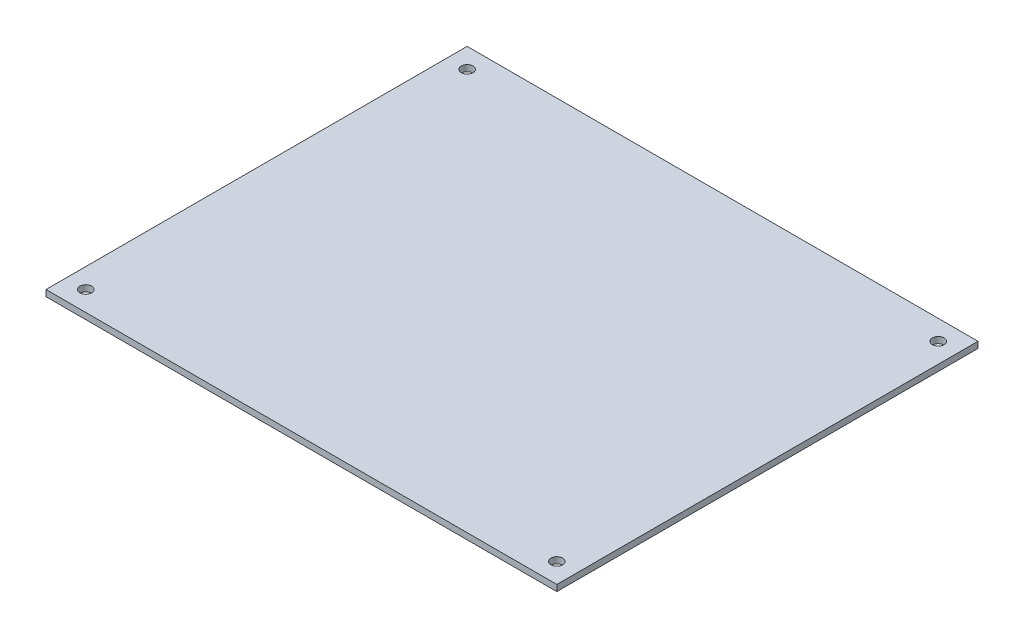
ISO-10303-21;
HEADER;
FILE_DESCRIPTION(('STEP AP214'),'2;1');
FILE_NAME('part.step','',(''),(''),'','','');
FILE_SCHEMA(('AUTOMOTIVE_DESIGN { 1 0 10303 214 1 1 1 1 }'));
ENDSEC;
DATA;
#1=APPLICATION_CONTEXT('core data for automotive mechanical design processes');
#2=APPLICATION_PROTOCOL_DEFINITION('international standard','automotive_design',2000,#1);
#3=PRODUCT_CONTEXT('',#1,'mechanical');
#4=PRODUCT('Part','Part','',(#3));
#5=PRODUCT_RELATED_PRODUCT_CATEGORY('part','',(#4));
#6=PRODUCT_DEFINITION_FORMATION('','',#4);
#7=PRODUCT_DEFINITION_CONTEXT('part definition',#1,'design');
#8=PRODUCT_DEFINITION('design','',#6,#7);
#9=PRODUCT_DEFINITION_SHAPE('','',#8);
#10=(LENGTH_UNIT() NAMED_UNIT(*) SI_UNIT(.MILLI.,.METRE.));
#11=(NAMED_UNIT(*) PLANE_ANGLE_UNIT() SI_UNIT($,.RADIAN.));
#12=(NAMED_UNIT(*) SI_UNIT($,.STERADIAN.) SOLID_ANGLE_UNIT());
#13=UNCERTAINTY_MEASURE_WITH_UNIT(LENGTH_MEASURE(1.E-05),#10,'distance_accuracy_value','');
#14=(GEOMETRIC_REPRESENTATION_CONTEXT(3) GLOBAL_UNCERTAINTY_ASSIGNED_CONTEXT((#13)) GLOBAL_UNIT_ASSIGNED_CONTEXT((#10,
#11,#12)) REPRESENTATION_CONTEXT('',''));
#15=CARTESIAN_POINT('',(0.,0.,0.));
#16=DIRECTION('',(0.,0.,1.));
#17=DIRECTION('',(1.,0.,0.));
#18=AXIS2_PLACEMENT_3D('',#15,#16,#17);
#19=CARTESIAN_POINT('',(65.5,1.6,54.));
#20=DIRECTION('',(0.,1.,0.));
#21=DIRECTION('',(0.,0.,1.));
#22=AXIS2_PLACEMENT_3D('',#19,#20,#21);
#23=PLANE('',#22);
#24=CARTESIAN_POINT('',(60.4,1.6,48.9));
#25=DIRECTION('',(0.,1.,0.));
#26=DIRECTION('',(0.,0.,1.));
#27=AXIS2_PLACEMENT_3D('',#24,#25,#26);
#28=CIRCLE('',#27,1.5);
#29=CARTESIAN_POINT('',(60.4,1.6,50.4));
#30=VERTEX_POINT('',#29);
#31=EDGE_CURVE('E119',#30,#30,#28,.T.);
#32=ORIENTED_EDGE('',*,*,#31,.F.);
#33=EDGE_LOOP('',(#32));
#34=FACE_BOUND('',#33,.T.);
#35=CARTESIAN_POINT('',(-60.4,1.6,-48.9));
#36=DIRECTION('',(0.,1.,0.));
#37=DIRECTION('',(0.,0.,1.));
#38=AXIS2_PLACEMENT_3D('',#35,#36,#37);
#39=CIRCLE('',#38,1.5);
#40=CARTESIAN_POINT('',(-60.4,1.6,-47.4));
#41=VERTEX_POINT('',#40);
#42=EDGE_CURVE('E98',#41,#41,#39,.T.);
#43=ORIENTED_EDGE('',*,*,#42,.F.);
#44=EDGE_LOOP('',(#43));
#45=FACE_BOUND('',#44,.T.);
#46=DIRECTION('',(0.,0.,-1.));
#47=VECTOR('',#46,1.);
#48=CARTESIAN_POINT('',(65.5,1.6,-54.));
#49=LINE('',#48,#47);
#50=CARTESIAN_POINT('',(65.5,1.6,54.));
#51=VERTEX_POINT('',#50);
#52=CARTESIAN_POINT('',(65.5,1.6,-54.));
#53=VERTEX_POINT('',#52);
#54=EDGE_CURVE('E83',#51,#53,#49,.T.);
#55=ORIENTED_EDGE('',*,*,#54,.T.);
#56=DIRECTION('',(-1.,0.,0.));
#57=VECTOR('',#56,1.);
#58=CARTESIAN_POINT('',(-65.5,1.6,-54.));
#59=LINE('',#58,#57);
#60=CARTESIAN_POINT('',(-65.5,1.6,-54.));
#61=VERTEX_POINT('',#60);
#62=EDGE_CURVE('E78',#53,#61,#59,.T.);
#63=ORIENTED_EDGE('',*,*,#62,.T.);
#64=DIRECTION('',(0.,0.,1.));
#65=VECTOR('',#64,1.);
#66=CARTESIAN_POINT('',(-65.5,1.6,-54.));
#67=LINE('',#66,#65);
#68=CARTESIAN_POINT('',(-65.5,1.6,54.));
#69=VERTEX_POINT('',#68);
#70=EDGE_CURVE('E81',#61,#69,#67,.T.);
#71=ORIENTED_EDGE('',*,*,#70,.T.);
#72=DIRECTION('',(1.,0.,0.));
#73=VECTOR('',#72,1.);
#74=CARTESIAN_POINT('',(-65.5,1.6,54.));
#75=LINE('',#74,#73);
#76=EDGE_CURVE('E48',#69,#51,#75,.T.);
#77=ORIENTED_EDGE('',*,*,#76,.T.);
#78=EDGE_LOOP('',(#55,#63,#71,#77));
#79=FACE_BOUND('',#78,.T.);
#80=CARTESIAN_POINT('',(-60.4,1.6,48.9));
#81=DIRECTION('',(0.,1.,0.));
#82=DIRECTION('',(0.,0.,1.));
#83=AXIS2_PLACEMENT_3D('',#80,#81,#82);
#84=CIRCLE('',#83,1.5);
#85=CARTESIAN_POINT('',(-60.4,1.6,50.4));
#86=VERTEX_POINT('',#85);
#87=EDGE_CURVE('E113',#86,#86,#84,.T.);
#88=ORIENTED_EDGE('',*,*,#87,.F.);
#89=EDGE_LOOP('',(#88));
#90=FACE_BOUND('',#89,.T.);
#91=CARTESIAN_POINT('',(60.4,1.6,-48.9));
#92=DIRECTION('',(0.,1.,0.));
#93=DIRECTION('',(0.,0.,1.));
#94=AXIS2_PLACEMENT_3D('',#91,#92,#93);
#95=CIRCLE('',#94,1.5);
#96=CARTESIAN_POINT('',(60.4,1.6,-47.4));
#97=VERTEX_POINT('',#96);
#98=EDGE_CURVE('E125',#97,#97,#95,.T.);
#99=ORIENTED_EDGE('',*,*,#98,.F.);
#100=EDGE_LOOP('',(#99));
#101=FACE_BOUND('',#100,.T.);
#102=ADVANCED_FACE('F31',(#34,#45,#79,#90,#101),#23,.T.);
#103=CARTESIAN_POINT('',(65.5,0.,54.));
#104=DIRECTION('',(0.,1.,0.));
#105=DIRECTION('',(0.,0.,1.));
#106=AXIS2_PLACEMENT_3D('',#103,#104,#105);
#107=PLANE('',#106);
#108=CARTESIAN_POINT('',(60.4,0.,48.9));
#109=DIRECTION('',(0.,1.,0.));
#110=DIRECTION('',(0.,0.,1.));
#111=AXIS2_PLACEMENT_3D('',#108,#109,#110);
#112=CIRCLE('',#111,1.5);
#113=CARTESIAN_POINT('',(60.4,0.,50.4));
#114=VERTEX_POINT('',#113);
#115=EDGE_CURVE('E122',#114,#114,#112,.T.);
#116=ORIENTED_EDGE('',*,*,#115,.T.);
#117=EDGE_LOOP('',(#116));
#118=FACE_BOUND('',#117,.T.);
#119=CARTESIAN_POINT('',(-60.4,0.,-48.9));
#120=DIRECTION('',(0.,1.,0.));
#121=DIRECTION('',(0.,0.,1.));
#122=AXIS2_PLACEMENT_3D('',#119,#120,#121);
#123=CIRCLE('',#122,1.5);
#124=CARTESIAN_POINT('',(-60.4,0.,-47.4));
#125=VERTEX_POINT('',#124);
#126=EDGE_CURVE('E110',#125,#125,#123,.T.);
#127=ORIENTED_EDGE('',*,*,#126,.T.);
#128=EDGE_LOOP('',(#127));
#129=FACE_BOUND('',#128,.T.);
#130=DIRECTION('',(0.,0.,-1.));
#131=VECTOR('',#130,1.);
#132=CARTESIAN_POINT('',(65.5,0.,-54.));
#133=LINE('',#132,#131);
#134=CARTESIAN_POINT('',(65.5,0.,54.));
#135=VERTEX_POINT('',#134);
#136=CARTESIAN_POINT('',(65.5,0.,-54.));
#137=VERTEX_POINT('',#136);
#138=EDGE_CURVE('E95',#135,#137,#133,.T.);
#139=ORIENTED_EDGE('',*,*,#138,.F.);
#140=DIRECTION('',(1.,0.,0.));
#141=VECTOR('',#140,1.);
#142=CARTESIAN_POINT('',(-65.5,0.,54.));
#143=LINE('',#142,#141);
#144=CARTESIAN_POINT('',(-65.5,0.,54.));
#145=VERTEX_POINT('',#144);
#146=EDGE_CURVE('E71',#145,#135,#143,.T.);
#147=ORIENTED_EDGE('',*,*,#146,.F.);
#148=DIRECTION('',(0.,0.,1.));
#149=VECTOR('',#148,1.);
#150=CARTESIAN_POINT('',(-65.5,0.,-54.));
#151=LINE('',#150,#149);
#152=CARTESIAN_POINT('',(-65.5,0.,-54.));
#153=VERTEX_POINT('',#152);
#154=EDGE_CURVE('E65',#153,#145,#151,.T.);
#155=ORIENTED_EDGE('',*,*,#154,.F.);
#156=DIRECTION('',(-1.,0.,0.));
#157=VECTOR('',#156,1.);
#158=CARTESIAN_POINT('',(-65.5,0.,-54.));
#159=LINE('',#158,#157);
#160=EDGE_CURVE('E87',#137,#153,#159,.T.);
#161=ORIENTED_EDGE('',*,*,#160,.F.);
#162=EDGE_LOOP('',(#139,#147,#155,#161));
#163=FACE_BOUND('',#162,.T.);
#164=CARTESIAN_POINT('',(-60.4,0.,48.9));
#165=DIRECTION('',(0.,1.,0.));
#166=DIRECTION('',(0.,0.,1.));
#167=AXIS2_PLACEMENT_3D('',#164,#165,#166);
#168=CIRCLE('',#167,1.5);
#169=CARTESIAN_POINT('',(-60.4,0.,50.4));
#170=VERTEX_POINT('',#169);
#171=EDGE_CURVE('E116',#170,#170,#168,.T.);
#172=ORIENTED_EDGE('',*,*,#171,.T.);
#173=EDGE_LOOP('',(#172));
#174=FACE_BOUND('',#173,.T.);
#175=CARTESIAN_POINT('',(60.4,0.,-48.9));
#176=DIRECTION('',(0.,1.,0.));
#177=DIRECTION('',(0.,0.,1.));
#178=AXIS2_PLACEMENT_3D('',#175,#176,#177);
#179=CIRCLE('',#178,1.5);
#180=CARTESIAN_POINT('',(60.4,0.,-47.4));
#181=VERTEX_POINT('',#180);
#182=EDGE_CURVE('E128',#181,#181,#179,.T.);
#183=ORIENTED_EDGE('',*,*,#182,.T.);
#184=EDGE_LOOP('',(#183));
#185=FACE_BOUND('',#184,.T.);
#186=ADVANCED_FACE('F106',(#118,#129,#163,#174,#185),#107,.F.);
#187=CARTESIAN_POINT('',(65.5,1.6,-54.));
#188=DIRECTION('',(-1.,0.,0.));
#189=DIRECTION('',(0.,0.,1.));
#190=AXIS2_PLACEMENT_3D('',#187,#188,#189);
#191=PLANE('',#190);
#192=ORIENTED_EDGE('',*,*,#138,.T.);
#193=DIRECTION('',(0.,-1.,0.));
#194=VECTOR('',#193,1.);
#195=CARTESIAN_POINT('',(65.5,1.6,-54.));
#196=LINE('',#195,#194);
#197=EDGE_CURVE('E11',#53,#137,#196,.T.);
#198=ORIENTED_EDGE('',*,*,#197,.F.);
#199=ORIENTED_EDGE('',*,*,#54,.F.);
#200=DIRECTION('',(0.,-1.,0.));
#201=VECTOR('',#200,1.);
#202=CARTESIAN_POINT('',(65.5,1.6,54.));
#203=LINE('',#202,#201);
#204=EDGE_CURVE('E91',#51,#135,#203,.T.);
#205=ORIENTED_EDGE('',*,*,#204,.T.);
#206=EDGE_LOOP('',(#192,#198,#199,#205));
#207=FACE_BOUND('',#206,.T.);
#208=ADVANCED_FACE('F33',(#207),#191,.F.);
#209=CARTESIAN_POINT('',(-65.5,1.6,-54.));
#210=DIRECTION('',(0.,0.,1.));
#211=DIRECTION('',(1.,0.,0.));
#212=AXIS2_PLACEMENT_3D('',#209,#210,#211);
#213=PLANE('',#212);
#214=ORIENTED_EDGE('',*,*,#160,.T.);
#215=DIRECTION('',(0.,-1.,0.));
#216=VECTOR('',#215,1.);
#217=CARTESIAN_POINT('',(-65.5,1.6,-54.));
#218=LINE('',#217,#216);
#219=EDGE_CURVE('E40',#61,#153,#218,.T.);
#220=ORIENTED_EDGE('',*,*,#219,.F.);
#221=ORIENTED_EDGE('',*,*,#62,.F.);
#222=ORIENTED_EDGE('',*,*,#197,.T.);
#223=EDGE_LOOP('',(#214,#220,#221,#222));
#224=FACE_BOUND('',#223,.T.);
#225=ADVANCED_FACE('F86',(#224),#213,.F.);
#226=CARTESIAN_POINT('',(-65.5,1.6,-54.));
#227=DIRECTION('',(1.,0.,0.));
#228=DIRECTION('',(0.,0.,-1.));
#229=AXIS2_PLACEMENT_3D('',#226,#227,#228);
#230=PLANE('',#229);
#231=ORIENTED_EDGE('',*,*,#154,.T.);
#232=DIRECTION('',(0.,-1.,0.));
#233=VECTOR('',#232,1.);
#234=CARTESIAN_POINT('',(-65.5,1.6,54.));
#235=LINE('',#234,#233);
#236=EDGE_CURVE('E88',#69,#145,#235,.T.);
#237=ORIENTED_EDGE('',*,*,#236,.F.);
#238=ORIENTED_EDGE('',*,*,#70,.F.);
#239=ORIENTED_EDGE('',*,*,#219,.T.);
#240=EDGE_LOOP('',(#231,#237,#238,#239));
#241=FACE_BOUND('',#240,.T.);
#242=ADVANCED_FACE('F89',(#241),#230,.F.);
#243=CARTESIAN_POINT('',(-65.5,1.6,54.));
#244=DIRECTION('',(0.,0.,-1.));
#245=DIRECTION('',(-1.,0.,0.));
#246=AXIS2_PLACEMENT_3D('',#243,#244,#245);
#247=PLANE('',#246);
#248=ORIENTED_EDGE('',*,*,#146,.T.);
#249=ORIENTED_EDGE('',*,*,#204,.F.);
#250=ORIENTED_EDGE('',*,*,#76,.F.);
#251=ORIENTED_EDGE('',*,*,#236,.T.);
#252=EDGE_LOOP('',(#248,#249,#250,#251));
#253=FACE_BOUND('',#252,.T.);
#254=ADVANCED_FACE('F103',(#253),#247,.F.);
#255=CARTESIAN_POINT('',(-60.4,1.6,-48.9));
#256=DIRECTION('',(0.,-1.,0.));
#257=DIRECTION('',(0.,0.,-1.));
#258=AXIS2_PLACEMENT_3D('',#255,#256,#257);
#259=CYLINDRICAL_SURFACE('',#258,1.5);
#260=ORIENTED_EDGE('',*,*,#42,.T.);
#261=EDGE_LOOP('',(#260));
#262=FACE_BOUND('',#261,.T.);
#263=ORIENTED_EDGE('',*,*,#126,.F.);
#264=EDGE_LOOP('',(#263));
#265=FACE_BOUND('',#264,.T.);
#266=ADVANCED_FACE('F148',(#262,#265),#259,.F.);
#267=CARTESIAN_POINT('',(-60.4,1.6,48.9));
#268=DIRECTION('',(0.,-1.,0.));
#269=DIRECTION('',(0.,0.,-1.));
#270=AXIS2_PLACEMENT_3D('',#267,#268,#269);
#271=CYLINDRICAL_SURFACE('',#270,1.5);
#272=ORIENTED_EDGE('',*,*,#87,.T.);
#273=EDGE_LOOP('',(#272));
#274=FACE_BOUND('',#273,.T.);
#275=ORIENTED_EDGE('',*,*,#171,.F.);
#276=EDGE_LOOP('',(#275));
#277=FACE_BOUND('',#276,.T.);
#278=ADVANCED_FACE('F194',(#274,#277),#271,.F.);
#279=CARTESIAN_POINT('',(60.4,1.6,48.9));
#280=DIRECTION('',(0.,-1.,0.));
#281=DIRECTION('',(0.,0.,-1.));
#282=AXIS2_PLACEMENT_3D('',#279,#280,#281);
#283=CYLINDRICAL_SURFACE('',#282,1.5);
#284=ORIENTED_EDGE('',*,*,#31,.T.);
#285=EDGE_LOOP('',(#284));
#286=FACE_BOUND('',#285,.T.);
#287=ORIENTED_EDGE('',*,*,#115,.F.);
#288=EDGE_LOOP('',(#287));
#289=FACE_BOUND('',#288,.T.);
#290=ADVANCED_FACE('F202',(#286,#289),#283,.F.);
#291=CARTESIAN_POINT('',(60.4,1.6,-48.9));
#292=DIRECTION('',(0.,-1.,0.));
#293=DIRECTION('',(0.,0.,-1.));
#294=AXIS2_PLACEMENT_3D('',#291,#292,#293);
#295=CYLINDRICAL_SURFACE('',#294,1.5);
#296=ORIENTED_EDGE('',*,*,#98,.T.);
#297=EDGE_LOOP('',(#296));
#298=FACE_BOUND('',#297,.T.);
#299=ORIENTED_EDGE('',*,*,#182,.F.);
#300=EDGE_LOOP('',(#299));
#301=FACE_BOUND('',#300,.T.);
#302=ADVANCED_FACE('F134',(#298,#301),#295,.F.);
#303=CLOSED_SHELL('',(#102,#186,#208,#225,#242,#254,#266,#278,#290,#302));
#304=MANIFOLD_SOLID_BREP('B2',#303);
#305=ADVANCED_BREP_SHAPE_REPRESENTATION('',(#18,#304),#14);
#306=SHAPE_DEFINITION_REPRESENTATION(#9,#305);
ENDSEC;
END-ISO-10303-21;
